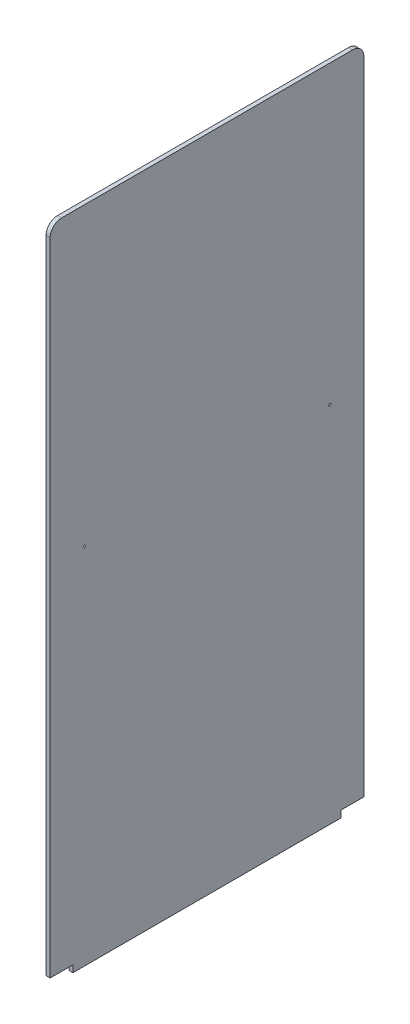
ISO-10303-21;
HEADER;
FILE_DESCRIPTION(('STEP AP214'),'2;1');
FILE_NAME('part.step','',(''),(''),'','','');
FILE_SCHEMA(('AUTOMOTIVE_DESIGN { 1 0 10303 214 1 1 1 1 }'));
ENDSEC;
DATA;
#1=APPLICATION_CONTEXT('core data for automotive mechanical design processes');
#2=APPLICATION_PROTOCOL_DEFINITION('international standard','automotive_design',2000,#1);
#3=PRODUCT_CONTEXT('',#1,'mechanical');
#4=PRODUCT('Part','Part','',(#3));
#5=PRODUCT_RELATED_PRODUCT_CATEGORY('part','',(#4));
#6=PRODUCT_DEFINITION_FORMATION('','',#4);
#7=PRODUCT_DEFINITION_CONTEXT('part definition',#1,'design');
#8=PRODUCT_DEFINITION('design','',#6,#7);
#9=PRODUCT_DEFINITION_SHAPE('','',#8);
#10=(LENGTH_UNIT() NAMED_UNIT(*) SI_UNIT(.MILLI.,.METRE.));
#11=(NAMED_UNIT(*) PLANE_ANGLE_UNIT() SI_UNIT($,.RADIAN.));
#12=(NAMED_UNIT(*) SI_UNIT($,.STERADIAN.) SOLID_ANGLE_UNIT());
#13=UNCERTAINTY_MEASURE_WITH_UNIT(LENGTH_MEASURE(1.E-05),#10,'distance_accuracy_value','');
#14=(GEOMETRIC_REPRESENTATION_CONTEXT(3) GLOBAL_UNCERTAINTY_ASSIGNED_CONTEXT((#13)) GLOBAL_UNIT_ASSIGNED_CONTEXT((#10,
#11,#12)) REPRESENTATION_CONTEXT('',''));
#15=CARTESIAN_POINT('',(0.,0.,0.));
#16=DIRECTION('',(0.,0.,1.));
#17=DIRECTION('',(1.,0.,0.));
#18=AXIS2_PLACEMENT_3D('',#15,#16,#17);
#19=CARTESIAN_POINT('',(0.9,-3.,69.));
#20=DIRECTION('',(0.,0.,-1.));
#21=DIRECTION('',(-1.,0.,0.));
#22=AXIS2_PLACEMENT_3D('',#19,#20,#21);
#23=PLANE('',#22);
#24=DIRECTION('',(0.,-1.,0.));
#25=VECTOR('',#24,1.);
#26=CARTESIAN_POINT('',(0.9,-3.,69.));
#27=LINE('',#26,#25);
#28=CARTESIAN_POINT('',(0.9,282.,69.));
#29=VERTEX_POINT('',#28);
#30=CARTESIAN_POINT('',(0.9,0.,69.));
#31=VERTEX_POINT('',#30);
#32=EDGE_CURVE('E134',#29,#31,#27,.T.);
#33=ORIENTED_EDGE('',*,*,#32,.F.);
#34=DIRECTION('',(-1.,0.,0.));
#35=VECTOR('',#34,1.);
#36=CARTESIAN_POINT('',(0.9,282.,69.));
#37=LINE('',#36,#35);
#38=CARTESIAN_POINT('',(-0.9,282.,69.));
#39=VERTEX_POINT('',#38);
#40=EDGE_CURVE('E11',#29,#39,#37,.T.);
#41=ORIENTED_EDGE('',*,*,#40,.T.);
#42=DIRECTION('',(0.,-1.,0.));
#43=VECTOR('',#42,1.);
#44=CARTESIAN_POINT('',(-0.9,-3.,69.));
#45=LINE('',#44,#43);
#46=CARTESIAN_POINT('',(-0.9,0.,69.));
#47=VERTEX_POINT('',#46);
#48=EDGE_CURVE('E160',#39,#47,#45,.T.);
#49=ORIENTED_EDGE('',*,*,#48,.T.);
#50=DIRECTION('',(1.,0.,0.));
#51=VECTOR('',#50,1.);
#52=CARTESIAN_POINT('',(0.9,0.,69.));
#53=LINE('',#52,#51);
#54=EDGE_CURVE('E144',#47,#31,#53,.T.);
#55=ORIENTED_EDGE('',*,*,#54,.T.);
#56=EDGE_LOOP('',(#33,#41,#49,#55));
#57=FACE_BOUND('',#56,.T.);
#58=ADVANCED_FACE('F34',(#57),#23,.F.);
#59=CARTESIAN_POINT('',(0.9,-3.,69.));
#60=DIRECTION('',(0.,1.,0.));
#61=DIRECTION('',(0.,0.,1.));
#62=AXIS2_PLACEMENT_3D('',#59,#60,#61);
#63=PLANE('',#62);
#64=DIRECTION('',(0.,0.,-1.));
#65=VECTOR('',#64,1.);
#66=CARTESIAN_POINT('',(0.9,-3.,69.));
#67=LINE('',#66,#65);
#68=CARTESIAN_POINT('',(0.9,-3.,59.));
#69=VERTEX_POINT('',#68);
#70=CARTESIAN_POINT('',(0.9,-3.,-59.));
#71=VERTEX_POINT('',#70);
#72=EDGE_CURVE('E162',#69,#71,#67,.T.);
#73=ORIENTED_EDGE('',*,*,#72,.F.);
#74=DIRECTION('',(-1.,0.,0.));
#75=VECTOR('',#74,1.);
#76=CARTESIAN_POINT('',(0.9,-3.,59.));
#77=LINE('',#76,#75);
#78=CARTESIAN_POINT('',(-0.9,-3.,59.));
#79=VERTEX_POINT('',#78);
#80=EDGE_CURVE('E125',#69,#79,#77,.T.);
#81=ORIENTED_EDGE('',*,*,#80,.T.);
#82=DIRECTION('',(0.,0.,-1.));
#83=VECTOR('',#82,1.);
#84=CARTESIAN_POINT('',(-0.9,-3.,69.));
#85=LINE('',#84,#83);
#86=CARTESIAN_POINT('',(-0.9,-3.,-59.));
#87=VERTEX_POINT('',#86);
#88=EDGE_CURVE('E171',#79,#87,#85,.T.);
#89=ORIENTED_EDGE('',*,*,#88,.T.);
#90=DIRECTION('',(1.,0.,0.));
#91=VECTOR('',#90,1.);
#92=CARTESIAN_POINT('',(0.9,-3.,-59.));
#93=LINE('',#92,#91);
#94=EDGE_CURVE('E157',#87,#71,#93,.T.);
#95=ORIENTED_EDGE('',*,*,#94,.T.);
#96=EDGE_LOOP('',(#73,#81,#89,#95));
#97=FACE_BOUND('',#96,.T.);
#98=ADVANCED_FACE('F221',(#97),#63,.F.);
#99=CARTESIAN_POINT('',(0.9,-3.,-69.));
#100=DIRECTION('',(0.,0.,1.));
#101=DIRECTION('',(1.,0.,0.));
#102=AXIS2_PLACEMENT_3D('',#99,#100,#101);
#103=PLANE('',#102);
#104=DIRECTION('',(0.,1.,0.));
#105=VECTOR('',#104,1.);
#106=CARTESIAN_POINT('',(-0.9,-3.,-69.));
#107=LINE('',#106,#105);
#108=CARTESIAN_POINT('',(-0.9,0.,-69.));
#109=VERTEX_POINT('',#108);
#110=CARTESIAN_POINT('',(-0.9,282.,-69.));
#111=VERTEX_POINT('',#110);
#112=EDGE_CURVE('E173',#109,#111,#107,.T.);
#113=ORIENTED_EDGE('',*,*,#112,.T.);
#114=DIRECTION('',(-1.,0.,0.));
#115=VECTOR('',#114,1.);
#116=CARTESIAN_POINT('',(0.9,282.,-69.));
#117=LINE('',#116,#115);
#118=CARTESIAN_POINT('',(0.9,282.,-69.));
#119=VERTEX_POINT('',#118);
#120=EDGE_CURVE('E57',#111,#119,#117,.F.);
#121=ORIENTED_EDGE('',*,*,#120,.T.);
#122=DIRECTION('',(0.,1.,0.));
#123=VECTOR('',#122,1.);
#124=CARTESIAN_POINT('',(0.9,-3.,-69.));
#125=LINE('',#124,#123);
#126=CARTESIAN_POINT('',(0.9,0.,-69.));
#127=VERTEX_POINT('',#126);
#128=EDGE_CURVE('E165',#127,#119,#125,.T.);
#129=ORIENTED_EDGE('',*,*,#128,.F.);
#130=DIRECTION('',(-1.,0.,0.));
#131=VECTOR('',#130,1.);
#132=CARTESIAN_POINT('',(0.9,0.,-69.));
#133=LINE('',#132,#131);
#134=EDGE_CURVE('E154',#127,#109,#133,.T.);
#135=ORIENTED_EDGE('',*,*,#134,.T.);
#136=EDGE_LOOP('',(#113,#121,#129,#135));
#137=FACE_BOUND('',#136,.T.);
#138=ADVANCED_FACE('F212',(#137),#103,.F.);
#139=CARTESIAN_POINT('',(0.9,287.,69.));
#140=DIRECTION('',(0.,-1.,0.));
#141=DIRECTION('',(0.,0.,-1.));
#142=AXIS2_PLACEMENT_3D('',#139,#140,#141);
#143=PLANE('',#142);
#144=DIRECTION('',(0.,0.,1.));
#145=VECTOR('',#144,1.);
#146=CARTESIAN_POINT('',(0.9,287.,69.));
#147=LINE('',#146,#145);
#148=CARTESIAN_POINT('',(0.9,287.,-64.));
#149=VERTEX_POINT('',#148);
#150=CARTESIAN_POINT('',(0.9,287.,64.));
#151=VERTEX_POINT('',#150);
#152=EDGE_CURVE('E167',#149,#151,#147,.T.);
#153=ORIENTED_EDGE('',*,*,#152,.F.);
#154=DIRECTION('',(-1.,0.,0.));
#155=VECTOR('',#154,1.);
#156=CARTESIAN_POINT('',(0.9,287.,-64.));
#157=LINE('',#156,#155);
#158=CARTESIAN_POINT('',(-0.9,287.,-64.));
#159=VERTEX_POINT('',#158);
#160=EDGE_CURVE('E190',#149,#159,#157,.T.);
#161=ORIENTED_EDGE('',*,*,#160,.T.);
#162=DIRECTION('',(0.,0.,1.));
#163=VECTOR('',#162,1.);
#164=CARTESIAN_POINT('',(-0.9,287.,69.));
#165=LINE('',#164,#163);
#166=CARTESIAN_POINT('',(-0.9,287.,64.));
#167=VERTEX_POINT('',#166);
#168=EDGE_CURVE('E163',#159,#167,#165,.T.);
#169=ORIENTED_EDGE('',*,*,#168,.T.);
#170=DIRECTION('',(-1.,0.,0.));
#171=VECTOR('',#170,1.);
#172=CARTESIAN_POINT('',(0.9,287.,64.));
#173=LINE('',#172,#171);
#174=EDGE_CURVE('E183',#167,#151,#173,.F.);
#175=ORIENTED_EDGE('',*,*,#174,.T.);
#176=EDGE_LOOP('',(#153,#161,#169,#175));
#177=FACE_BOUND('',#176,.T.);
#178=ADVANCED_FACE('F204',(#177),#143,.F.);
#179=CARTESIAN_POINT('',(0.9,287.,69.));
#180=DIRECTION('',(-1.,0.,0.));
#181=DIRECTION('',(0.,0.,1.));
#182=AXIS2_PLACEMENT_3D('',#179,#180,#181);
#183=PLANE('',#182);
#184=CARTESIAN_POINT('',(0.9,156.839120739644,-54.));
#185=DIRECTION('',(1.,0.,0.));
#186=DIRECTION('',(0.,0.,-1.));
#187=AXIS2_PLACEMENT_3D('',#184,#185,#186);
#188=CIRCLE('',#187,0.499999999999999);
#189=CARTESIAN_POINT('',(0.9,156.839120739644,-54.5));
#190=VERTEX_POINT('',#189);
#191=EDGE_CURVE('E188',#190,#190,#188,.T.);
#192=ORIENTED_EDGE('',*,*,#191,.F.);
#193=EDGE_LOOP('',(#192));
#194=FACE_BOUND('',#193,.T.);
#195=CARTESIAN_POINT('',(0.9,156.839120739644,54.));
#196=DIRECTION('',(1.,0.,0.));
#197=DIRECTION('',(0.,0.,-1.));
#198=AXIS2_PLACEMENT_3D('',#195,#196,#197);
#199=CIRCLE('',#198,0.499999999999999);
#200=CARTESIAN_POINT('',(0.9,156.839120739644,53.5));
#201=VERTEX_POINT('',#200);
#202=EDGE_CURVE('E138',#201,#201,#199,.T.);
#203=ORIENTED_EDGE('',*,*,#202,.F.);
#204=EDGE_LOOP('',(#203));
#205=FACE_BOUND('',#204,.T.);
#206=ORIENTED_EDGE('',*,*,#128,.T.);
#207=CARTESIAN_POINT('',(0.9,282.,-64.));
#208=DIRECTION('',(-1.,0.,0.));
#209=DIRECTION('',(0.,0.,1.));
#210=AXIS2_PLACEMENT_3D('',#207,#208,#209);
#211=CIRCLE('',#210,5.);
#212=EDGE_CURVE('E42',#119,#149,#211,.F.);
#213=ORIENTED_EDGE('',*,*,#212,.T.);
#214=ORIENTED_EDGE('',*,*,#152,.T.);
#215=CARTESIAN_POINT('',(0.9,282.,64.));
#216=DIRECTION('',(-1.,0.,0.));
#217=DIRECTION('',(0.,0.,1.));
#218=AXIS2_PLACEMENT_3D('',#215,#216,#217);
#219=CIRCLE('',#218,5.);
#220=EDGE_CURVE('E49',#151,#29,#219,.F.);
#221=ORIENTED_EDGE('',*,*,#220,.T.);
#222=ORIENTED_EDGE('',*,*,#32,.T.);
#223=DIRECTION('',(0.,0.,1.));
#224=VECTOR('',#223,1.);
#225=CARTESIAN_POINT('',(0.9,0.,83.039147707429));
#226=LINE('',#225,#224);
#227=CARTESIAN_POINT('',(0.9,0.,59.));
#228=VERTEX_POINT('',#227);
#229=EDGE_CURVE('E119',#228,#31,#226,.T.);
#230=ORIENTED_EDGE('',*,*,#229,.F.);
#231=DIRECTION('',(0.,1.,0.));
#232=VECTOR('',#231,1.);
#233=CARTESIAN_POINT('',(0.9,0.,59.));
#234=LINE('',#233,#232);
#235=EDGE_CURVE('E126',#69,#228,#234,.T.);
#236=ORIENTED_EDGE('',*,*,#235,.F.);
#237=ORIENTED_EDGE('',*,*,#72,.T.);
#238=DIRECTION('',(0.,-1.,0.));
#239=VECTOR('',#238,1.);
#240=CARTESIAN_POINT('',(0.9,0.,-59.));
#241=LINE('',#240,#239);
#242=CARTESIAN_POINT('',(0.9,0.,-59.));
#243=VERTEX_POINT('',#242);
#244=EDGE_CURVE('E149',#243,#71,#241,.T.);
#245=ORIENTED_EDGE('',*,*,#244,.F.);
#246=DIRECTION('',(0.,0.,1.));
#247=VECTOR('',#246,1.);
#248=CARTESIAN_POINT('',(0.9,0.,-83.039147707429));
#249=LINE('',#248,#247);
#250=EDGE_CURVE('E146',#127,#243,#249,.T.);
#251=ORIENTED_EDGE('',*,*,#250,.F.);
#252=EDGE_LOOP('',(#206,#213,#214,#221,#222,#230,#236,#237,#245,#251));
#253=FACE_BOUND('',#252,.T.);
#254=ADVANCED_FACE('F133',(#194,#205,#253),#183,.F.);
#255=CARTESIAN_POINT('',(-0.9,287.,69.));
#256=DIRECTION('',(-1.,0.,0.));
#257=DIRECTION('',(0.,0.,1.));
#258=AXIS2_PLACEMENT_3D('',#255,#256,#257);
#259=PLANE('',#258);
#260=CARTESIAN_POINT('',(-0.9,156.839120739644,-54.));
#261=DIRECTION('',(-1.,0.,0.));
#262=DIRECTION('',(0.,0.,1.));
#263=AXIS2_PLACEMENT_3D('',#260,#261,#262);
#264=CIRCLE('',#263,0.499999999999999);
#265=CARTESIAN_POINT('',(-0.9,156.839120739644,-53.5));
#266=VERTEX_POINT('',#265);
#267=EDGE_CURVE('E185',#266,#266,#264,.T.);
#268=ORIENTED_EDGE('',*,*,#267,.F.);
#269=EDGE_LOOP('',(#268));
#270=FACE_BOUND('',#269,.T.);
#271=CARTESIAN_POINT('',(-0.9,156.839120739644,54.));
#272=DIRECTION('',(-1.,0.,0.));
#273=DIRECTION('',(0.,0.,1.));
#274=AXIS2_PLACEMENT_3D('',#271,#272,#273);
#275=CIRCLE('',#274,0.499999999999999);
#276=CARTESIAN_POINT('',(-0.9,156.839120739644,54.5));
#277=VERTEX_POINT('',#276);
#278=EDGE_CURVE('E135',#277,#277,#275,.T.);
#279=ORIENTED_EDGE('',*,*,#278,.F.);
#280=EDGE_LOOP('',(#279));
#281=FACE_BOUND('',#280,.T.);
#282=ORIENTED_EDGE('',*,*,#168,.F.);
#283=CARTESIAN_POINT('',(-0.9,282.,-64.));
#284=DIRECTION('',(-1.,0.,0.));
#285=DIRECTION('',(0.,0.,1.));
#286=AXIS2_PLACEMENT_3D('',#283,#284,#285);
#287=CIRCLE('',#286,5.);
#288=EDGE_CURVE('E195',#159,#111,#287,.T.);
#289=ORIENTED_EDGE('',*,*,#288,.T.);
#290=ORIENTED_EDGE('',*,*,#112,.F.);
#291=DIRECTION('',(0.,0.,-1.));
#292=VECTOR('',#291,1.);
#293=CARTESIAN_POINT('',(-0.9,0.,69.));
#294=LINE('',#293,#292);
#295=CARTESIAN_POINT('',(-0.9,0.,-59.));
#296=VERTEX_POINT('',#295);
#297=EDGE_CURVE('E169',#296,#109,#294,.T.);
#298=ORIENTED_EDGE('',*,*,#297,.F.);
#299=DIRECTION('',(0.,1.,0.));
#300=VECTOR('',#299,1.);
#301=CARTESIAN_POINT('',(-0.9,287.,-59.));
#302=LINE('',#301,#300);
#303=EDGE_CURVE('E178',#87,#296,#302,.T.);
#304=ORIENTED_EDGE('',*,*,#303,.F.);
#305=ORIENTED_EDGE('',*,*,#88,.F.);
#306=DIRECTION('',(0.,-1.,0.));
#307=VECTOR('',#306,1.);
#308=CARTESIAN_POINT('',(-0.9,287.,59.));
#309=LINE('',#308,#307);
#310=CARTESIAN_POINT('',(-0.9,0.,59.));
#311=VERTEX_POINT('',#310);
#312=EDGE_CURVE('E181',#311,#79,#309,.T.);
#313=ORIENTED_EDGE('',*,*,#312,.F.);
#314=DIRECTION('',(0.,0.,-1.));
#315=VECTOR('',#314,1.);
#316=CARTESIAN_POINT('',(-0.9,0.,69.0000000000002));
#317=LINE('',#316,#315);
#318=EDGE_CURVE('E122',#47,#311,#317,.T.);
#319=ORIENTED_EDGE('',*,*,#318,.F.);
#320=ORIENTED_EDGE('',*,*,#48,.F.);
#321=CARTESIAN_POINT('',(-0.9,282.,64.));
#322=DIRECTION('',(-1.,0.,0.));
#323=DIRECTION('',(0.,0.,1.));
#324=AXIS2_PLACEMENT_3D('',#321,#322,#323);
#325=CIRCLE('',#324,5.);
#326=EDGE_CURVE('E193',#39,#167,#325,.T.);
#327=ORIENTED_EDGE('',*,*,#326,.T.);
#328=EDGE_LOOP('',(#282,#289,#290,#298,#304,#305,#313,#319,#320,#327));
#329=FACE_BOUND('',#328,.T.);
#330=ADVANCED_FACE('F210',(#270,#281,#329),#259,.T.);
#331=CARTESIAN_POINT('',(-2.1,0.,-59.));
#332=DIRECTION('',(0.,0.,1.));
#333=DIRECTION('',(1.,0.,0.));
#334=AXIS2_PLACEMENT_3D('',#331,#332,#333);
#335=PLANE('',#334);
#336=ORIENTED_EDGE('',*,*,#303,.T.);
#337=DIRECTION('',(1.,0.,0.));
#338=VECTOR('',#337,1.);
#339=CARTESIAN_POINT('',(-2.1,0.,-59.));
#340=LINE('',#339,#338);
#341=EDGE_CURVE('E152',#296,#243,#340,.T.);
#342=ORIENTED_EDGE('',*,*,#341,.T.);
#343=ORIENTED_EDGE('',*,*,#244,.T.);
#344=ORIENTED_EDGE('',*,*,#94,.F.);
#345=EDGE_LOOP('',(#336,#342,#343,#344));
#346=FACE_BOUND('',#345,.T.);
#347=ADVANCED_FACE('F218',(#346),#335,.F.);
#348=CARTESIAN_POINT('',(-2.1,0.,-83.039147707429));
#349=DIRECTION('',(0.,1.,0.));
#350=DIRECTION('',(0.,0.,1.));
#351=AXIS2_PLACEMENT_3D('',#348,#349,#350);
#352=PLANE('',#351);
#353=ORIENTED_EDGE('',*,*,#250,.T.);
#354=ORIENTED_EDGE('',*,*,#341,.F.);
#355=ORIENTED_EDGE('',*,*,#297,.T.);
#356=ORIENTED_EDGE('',*,*,#134,.F.);
#357=EDGE_LOOP('',(#353,#354,#355,#356));
#358=FACE_BOUND('',#357,.T.);
#359=ADVANCED_FACE('F214',(#358),#352,.F.);
#360=CARTESIAN_POINT('',(-2.1,0.,83.039147707429));
#361=DIRECTION('',(0.,1.,0.));
#362=DIRECTION('',(0.,0.,1.));
#363=AXIS2_PLACEMENT_3D('',#360,#361,#362);
#364=PLANE('',#363);
#365=ORIENTED_EDGE('',*,*,#318,.T.);
#366=DIRECTION('',(1.,0.,0.));
#367=VECTOR('',#366,1.);
#368=CARTESIAN_POINT('',(-2.1,0.,59.));
#369=LINE('',#368,#367);
#370=EDGE_CURVE('E114',#311,#228,#369,.T.);
#371=ORIENTED_EDGE('',*,*,#370,.T.);
#372=ORIENTED_EDGE('',*,*,#229,.T.);
#373=ORIENTED_EDGE('',*,*,#54,.F.);
#374=EDGE_LOOP('',(#365,#371,#372,#373));
#375=FACE_BOUND('',#374,.T.);
#376=ADVANCED_FACE('F116',(#375),#364,.F.);
#377=CARTESIAN_POINT('',(-2.1,0.,59.));
#378=DIRECTION('',(0.,0.,-1.));
#379=DIRECTION('',(-1.,0.,0.));
#380=AXIS2_PLACEMENT_3D('',#377,#378,#379);
#381=PLANE('',#380);
#382=ORIENTED_EDGE('',*,*,#235,.T.);
#383=ORIENTED_EDGE('',*,*,#370,.F.);
#384=ORIENTED_EDGE('',*,*,#312,.T.);
#385=ORIENTED_EDGE('',*,*,#80,.F.);
#386=EDGE_LOOP('',(#382,#383,#384,#385));
#387=FACE_BOUND('',#386,.T.);
#388=ADVANCED_FACE('F129',(#387),#381,.F.);
#389=CARTESIAN_POINT('',(-9.1,156.839120739644,54.));
#390=DIRECTION('',(1.,0.,0.));
#391=DIRECTION('',(0.,0.,-1.));
#392=AXIS2_PLACEMENT_3D('',#389,#390,#391);
#393=CYLINDRICAL_SURFACE('',#392,0.499999999999999);
#394=ORIENTED_EDGE('',*,*,#278,.T.);
#395=EDGE_LOOP('',(#394));
#396=FACE_BOUND('',#395,.T.);
#397=ORIENTED_EDGE('',*,*,#202,.T.);
#398=EDGE_LOOP('',(#397));
#399=FACE_BOUND('',#398,.T.);
#400=ADVANCED_FACE('F258',(#396,#399),#393,.F.);
#401=CARTESIAN_POINT('',(-9.1,156.839120739644,-54.));
#402=DIRECTION('',(1.,0.,0.));
#403=DIRECTION('',(0.,0.,-1.));
#404=AXIS2_PLACEMENT_3D('',#401,#402,#403);
#405=CYLINDRICAL_SURFACE('',#404,0.499999999999999);
#406=ORIENTED_EDGE('',*,*,#267,.T.);
#407=EDGE_LOOP('',(#406));
#408=FACE_BOUND('',#407,.T.);
#409=ORIENTED_EDGE('',*,*,#191,.T.);
#410=EDGE_LOOP('',(#409));
#411=FACE_BOUND('',#410,.T.);
#412=ADVANCED_FACE('F231',(#408,#411),#405,.F.);
#413=CARTESIAN_POINT('',(0.9,282.,-64.));
#414=DIRECTION('',(-1.,0.,0.));
#415=DIRECTION('',(0.,0.,1.));
#416=AXIS2_PLACEMENT_3D('',#413,#414,#415);
#417=CYLINDRICAL_SURFACE('',#416,5.);
#418=ORIENTED_EDGE('',*,*,#212,.F.);
#419=ORIENTED_EDGE('',*,*,#120,.F.);
#420=ORIENTED_EDGE('',*,*,#288,.F.);
#421=ORIENTED_EDGE('',*,*,#160,.F.);
#422=EDGE_LOOP('',(#418,#419,#420,#421));
#423=FACE_BOUND('',#422,.T.);
#424=ADVANCED_FACE('F207',(#423),#417,.T.);
#425=CARTESIAN_POINT('',(0.9,282.,64.));
#426=DIRECTION('',(-1.,0.,0.));
#427=DIRECTION('',(0.,0.,1.));
#428=AXIS2_PLACEMENT_3D('',#425,#426,#427);
#429=CYLINDRICAL_SURFACE('',#428,5.);
#430=ORIENTED_EDGE('',*,*,#220,.F.);
#431=ORIENTED_EDGE('',*,*,#174,.F.);
#432=ORIENTED_EDGE('',*,*,#326,.F.);
#433=ORIENTED_EDGE('',*,*,#40,.F.);
#434=EDGE_LOOP('',(#430,#431,#432,#433));
#435=FACE_BOUND('',#434,.T.);
#436=ADVANCED_FACE('F36',(#435),#429,.T.);
#437=CLOSED_SHELL('',(#58,#98,#138,#178,#254,#330,#347,#359,#376,#388,#400,#412,#424,#436));
#438=MANIFOLD_SOLID_BREP('B2',#437);
#439=ADVANCED_BREP_SHAPE_REPRESENTATION('',(#18,#438),#14);
#440=SHAPE_DEFINITION_REPRESENTATION(#9,#439);
ENDSEC;
END-ISO-10303-21;
